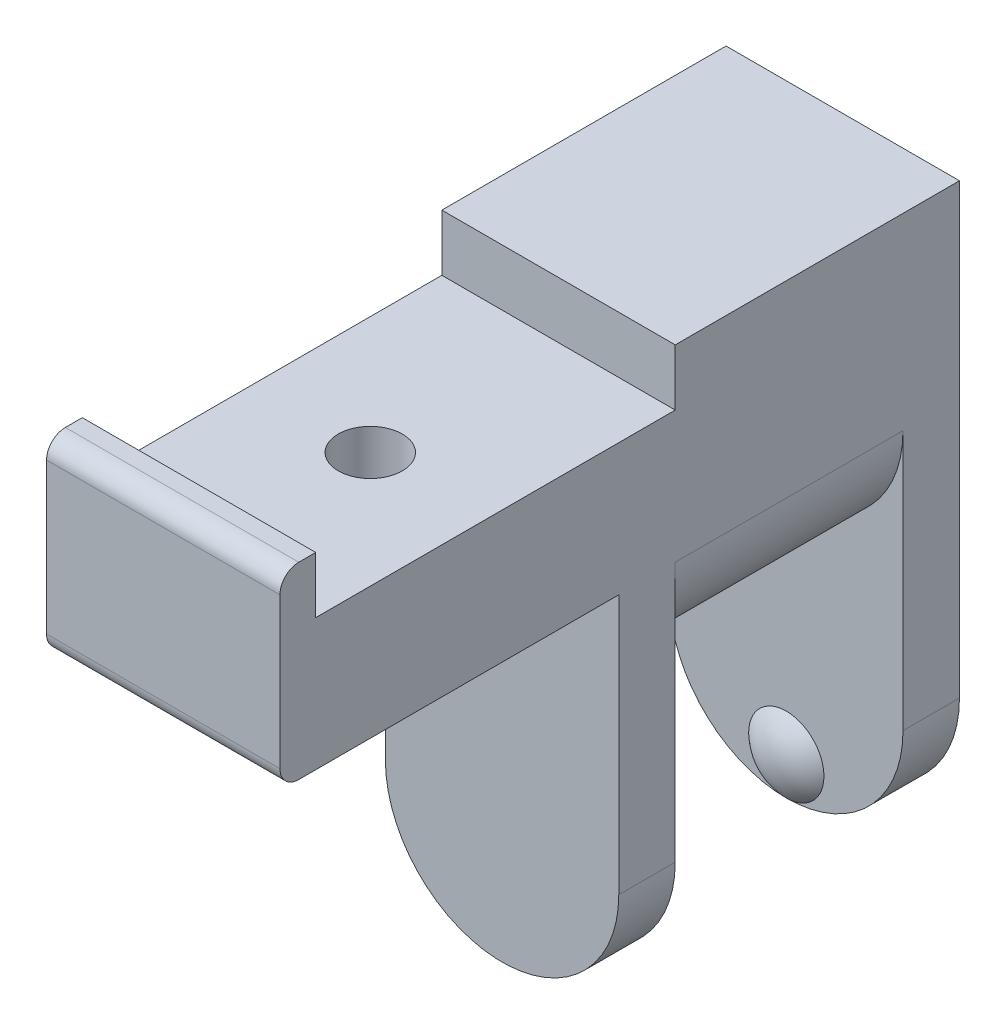
ISO-10303-21;
HEADER;
FILE_DESCRIPTION(('STEP AP214'),'2;1');
FILE_NAME('part.step','',(''),(''),'','','');
FILE_SCHEMA(('AUTOMOTIVE_DESIGN { 1 0 10303 214 1 1 1 1 }'));
ENDSEC;
DATA;
#1=APPLICATION_CONTEXT('core data for automotive mechanical design processes');
#2=APPLICATION_PROTOCOL_DEFINITION('international standard','automotive_design',2000,#1);
#3=PRODUCT_CONTEXT('',#1,'mechanical');
#4=PRODUCT('Part','Part','',(#3));
#5=PRODUCT_RELATED_PRODUCT_CATEGORY('part','',(#4));
#6=PRODUCT_DEFINITION_FORMATION('','',#4);
#7=PRODUCT_DEFINITION_CONTEXT('part definition',#1,'design');
#8=PRODUCT_DEFINITION('design','',#6,#7);
#9=PRODUCT_DEFINITION_SHAPE('','',#8);
#10=(LENGTH_UNIT() NAMED_UNIT(*) SI_UNIT(.MILLI.,.METRE.));
#11=(NAMED_UNIT(*) PLANE_ANGLE_UNIT() SI_UNIT($,.RADIAN.));
#12=(NAMED_UNIT(*) SI_UNIT($,.STERADIAN.) SOLID_ANGLE_UNIT());
#13=UNCERTAINTY_MEASURE_WITH_UNIT(LENGTH_MEASURE(1.E-05),#10,'distance_accuracy_value','');
#14=(GEOMETRIC_REPRESENTATION_CONTEXT(3) GLOBAL_UNCERTAINTY_ASSIGNED_CONTEXT((#13)) GLOBAL_UNIT_ASSIGNED_CONTEXT((#10,
#11,#12)) REPRESENTATION_CONTEXT('',''));
#15=CARTESIAN_POINT('',(0.,0.,0.));
#16=DIRECTION('',(0.,0.,1.));
#17=DIRECTION('',(1.,0.,0.));
#18=AXIS2_PLACEMENT_3D('',#15,#16,#17);
#19=CARTESIAN_POINT('',(12.4,0.,3.));
#20=DIRECTION('',(0.,0.,-1.));
#21=DIRECTION('',(0.,1.,0.));
#22=AXIS2_PLACEMENT_3D('',#19,#20,#21);
#23=PLANE('',#22);
#24=DIRECTION('',(0.,-1.,0.));
#25=VECTOR('',#24,1.);
#26=CARTESIAN_POINT('',(0.,0.,3.));
#27=LINE('',#26,#25);
#28=CARTESIAN_POINT('',(0.,0.,3.));
#29=VERTEX_POINT('',#28);
#30=CARTESIAN_POINT('',(0.,-13.8,3.));
#31=VERTEX_POINT('',#30);
#32=EDGE_CURVE('E284',#29,#31,#27,.T.);
#33=ORIENTED_EDGE('',*,*,#32,.T.);
#34=CARTESIAN_POINT('',(6.2,-13.8,3.));
#35=DIRECTION('',(0.,0.,-1.));
#36=DIRECTION('',(0.,1.,0.));
#37=AXIS2_PLACEMENT_3D('',#34,#35,#36);
#38=CIRCLE('',#37,6.2);
#39=CARTESIAN_POINT('',(12.4,-13.8,3.));
#40=VERTEX_POINT('',#39);
#41=EDGE_CURVE('E312',#31,#40,#38,.F.);
#42=ORIENTED_EDGE('',*,*,#41,.T.);
#43=DIRECTION('',(0.,-1.,0.));
#44=VECTOR('',#43,1.);
#45=CARTESIAN_POINT('',(12.4,0.,3.));
#46=LINE('',#45,#44);
#47=CARTESIAN_POINT('',(12.4,0.,3.));
#48=VERTEX_POINT('',#47);
#49=EDGE_CURVE('E268',#48,#40,#46,.T.);
#50=ORIENTED_EDGE('',*,*,#49,.F.);
#51=DIRECTION('',(-1.,0.,0.));
#52=VECTOR('',#51,1.);
#53=CARTESIAN_POINT('',(12.4,0.,3.));
#54=LINE('',#53,#52);
#55=EDGE_CURVE('E220',#48,#29,#54,.T.);
#56=ORIENTED_EDGE('',*,*,#55,.T.);
#57=EDGE_LOOP('',(#33,#42,#50,#56));
#58=FACE_BOUND('',#57,.T.);
#59=ADVANCED_FACE('F43',(#58),#23,.F.);
#60=CARTESIAN_POINT('',(12.4,0.,0.));
#61=DIRECTION('',(0.,0.,1.));
#62=DIRECTION('',(1.,0.,0.));
#63=AXIS2_PLACEMENT_3D('',#60,#61,#62);
#64=PLANE('',#63);
#65=DIRECTION('',(0.,1.,0.));
#66=VECTOR('',#65,1.);
#67=CARTESIAN_POINT('',(12.4,0.,0.));
#68=LINE('',#67,#66);
#69=CARTESIAN_POINT('',(12.4,-13.8,0.));
#70=VERTEX_POINT('',#69);
#71=CARTESIAN_POINT('',(12.4,0.,0.));
#72=VERTEX_POINT('',#71);
#73=EDGE_CURVE('E334',#70,#72,#68,.T.);
#74=ORIENTED_EDGE('',*,*,#73,.F.);
#75=CARTESIAN_POINT('',(6.2,-13.8,0.));
#76=DIRECTION('',(0.,0.,1.));
#77=DIRECTION('',(1.,0.,0.));
#78=AXIS2_PLACEMENT_3D('',#75,#76,#77);
#79=CIRCLE('',#78,6.2);
#80=CARTESIAN_POINT('',(0.,-13.8,0.));
#81=VERTEX_POINT('',#80);
#82=EDGE_CURVE('E301',#70,#81,#79,.F.);
#83=ORIENTED_EDGE('',*,*,#82,.T.);
#84=DIRECTION('',(0.,1.,0.));
#85=VECTOR('',#84,1.);
#86=CARTESIAN_POINT('',(0.,0.,0.));
#87=LINE('',#86,#85);
#88=CARTESIAN_POINT('',(0.,0.,0.));
#89=VERTEX_POINT('',#88);
#90=EDGE_CURVE('E196',#81,#89,#87,.T.);
#91=ORIENTED_EDGE('',*,*,#90,.T.);
#92=CARTESIAN_POINT('',(6.2,0.,0.));
#93=DIRECTION('',(0.,0.,-1.));
#94=DIRECTION('',(1.,0.,0.));
#95=AXIS2_PLACEMENT_3D('',#92,#93,#94);
#96=CIRCLE('',#95,6.2);
#97=EDGE_CURVE('E300',#72,#89,#96,.T.);
#98=ORIENTED_EDGE('',*,*,#97,.F.);
#99=EDGE_LOOP('',(#74,#83,#91,#98));
#100=FACE_BOUND('',#99,.T.);
#101=ADVANCED_FACE('F299',(#100),#64,.F.);
#102=CARTESIAN_POINT('',(12.4,0.,-12.1));
#103=DIRECTION('',(0.,0.,-1.));
#104=DIRECTION('',(0.,1.,0.));
#105=AXIS2_PLACEMENT_3D('',#102,#103,#104);
#106=PLANE('',#105);
#107=CARTESIAN_POINT('',(6.2,-13.8,-12.1));
#108=DIRECTION('',(0.,0.,-1.));
#109=DIRECTION('',(0.,1.,0.));
#110=AXIS2_PLACEMENT_3D('',#107,#108,#109);
#111=CIRCLE('',#110,6.2);
#112=CARTESIAN_POINT('',(0.,-13.8,-12.1));
#113=VERTEX_POINT('',#112);
#114=CARTESIAN_POINT('',(6.2,-20.,-12.1));
#115=VERTEX_POINT('',#114);
#116=EDGE_CURVE('E166',#113,#115,#111,.F.);
#117=ORIENTED_EDGE('',*,*,#116,.T.);
#118=CARTESIAN_POINT('',(6.2,-18.,-12.1));
#119=DIRECTION('',(0.,0.,1.));
#120=DIRECTION('',(1.,0.,0.));
#121=AXIS2_PLACEMENT_3D('',#118,#119,#120);
#122=CIRCLE('',#121,2.);
#123=EDGE_CURVE('E57',#115,#115,#122,.T.);
#124=ORIENTED_EDGE('',*,*,#123,.F.);
#125=CARTESIAN_POINT('',(12.4,-13.8,-12.1));
#126=VERTEX_POINT('',#125);
#127=EDGE_CURVE('E445',#115,#126,#111,.F.);
#128=ORIENTED_EDGE('',*,*,#127,.T.);
#129=DIRECTION('',(0.,-1.,0.));
#130=VECTOR('',#129,1.);
#131=CARTESIAN_POINT('',(12.4,0.,-12.1));
#132=LINE('',#131,#130);
#133=CARTESIAN_POINT('',(12.4,0.,-12.1));
#134=VERTEX_POINT('',#133);
#135=EDGE_CURVE('E337',#134,#126,#132,.T.);
#136=ORIENTED_EDGE('',*,*,#135,.F.);
#137=CARTESIAN_POINT('',(6.2,0.,-12.1));
#138=DIRECTION('',(0.,0.,-1.));
#139=DIRECTION('',(0.,1.,0.));
#140=AXIS2_PLACEMENT_3D('',#137,#138,#139);
#141=CIRCLE('',#140,6.2);
#142=CARTESIAN_POINT('',(0.,0.,-12.1));
#143=VERTEX_POINT('',#142);
#144=EDGE_CURVE('E316',#134,#143,#141,.T.);
#145=ORIENTED_EDGE('',*,*,#144,.T.);
#146=DIRECTION('',(0.,-1.,0.));
#147=VECTOR('',#146,1.);
#148=CARTESIAN_POINT('',(0.,0.,-12.1));
#149=LINE('',#148,#147);
#150=EDGE_CURVE('E190',#143,#113,#149,.T.);
#151=ORIENTED_EDGE('',*,*,#150,.T.);
#152=EDGE_LOOP('',(#117,#124,#128,#136,#145,#151));
#153=FACE_BOUND('',#152,.T.);
#154=ADVANCED_FACE('F384',(#153),#106,.F.);
#155=CARTESIAN_POINT('',(12.4,0.,-15.1));
#156=DIRECTION('',(0.,0.,1.));
#157=DIRECTION('',(0.,-1.,0.));
#158=AXIS2_PLACEMENT_3D('',#155,#156,#157);
#159=PLANE('',#158);
#160=DIRECTION('',(0.,1.,0.));
#161=VECTOR('',#160,1.);
#162=CARTESIAN_POINT('',(12.4,0.,-15.1));
#163=LINE('',#162,#161);
#164=CARTESIAN_POINT('',(12.4,-13.8,-15.1));
#165=VERTEX_POINT('',#164);
#166=CARTESIAN_POINT('',(12.4,10.,-15.1));
#167=VERTEX_POINT('',#166);
#168=EDGE_CURVE('E179',#165,#167,#163,.T.);
#169=ORIENTED_EDGE('',*,*,#168,.F.);
#170=CARTESIAN_POINT('',(6.2,-13.8,-15.1));
#171=DIRECTION('',(0.,0.,-1.));
#172=DIRECTION('',(1.,0.,0.));
#173=AXIS2_PLACEMENT_3D('',#170,#171,#172);
#174=CIRCLE('',#173,6.2);
#175=CARTESIAN_POINT('',(0.,-13.8,-15.1));
#176=VERTEX_POINT('',#175);
#177=EDGE_CURVE('E162',#165,#176,#174,.T.);
#178=ORIENTED_EDGE('',*,*,#177,.T.);
#179=DIRECTION('',(0.,1.,0.));
#180=VECTOR('',#179,1.);
#181=CARTESIAN_POINT('',(0.,0.,-15.1));
#182=LINE('',#181,#180);
#183=CARTESIAN_POINT('',(0.,10.,-15.1));
#184=VERTEX_POINT('',#183);
#185=EDGE_CURVE('E177',#176,#184,#182,.T.);
#186=ORIENTED_EDGE('',*,*,#185,.T.);
#187=DIRECTION('',(-1.,0.,0.));
#188=VECTOR('',#187,1.);
#189=CARTESIAN_POINT('',(12.4,10.,-15.1));
#190=LINE('',#189,#188);
#191=EDGE_CURVE('E217',#167,#184,#190,.T.);
#192=ORIENTED_EDGE('',*,*,#191,.F.);
#193=EDGE_LOOP('',(#169,#178,#186,#192));
#194=FACE_BOUND('',#193,.T.);
#195=ADVANCED_FACE('F175',(#194),#159,.F.);
#196=CARTESIAN_POINT('',(12.4,0.,19.1));
#197=DIRECTION('',(0.,0.,-1.));
#198=DIRECTION('',(-1.,0.,0.));
#199=AXIS2_PLACEMENT_3D('',#196,#197,#198);
#200=PLANE('',#199);
#201=DIRECTION('',(0.,-1.,0.));
#202=VECTOR('',#201,1.);
#203=CARTESIAN_POINT('',(0.,0.,19.1));
#204=LINE('',#203,#202);
#205=CARTESIAN_POINT('',(0.,9.99999999999999,19.1));
#206=VERTEX_POINT('',#205);
#207=CARTESIAN_POINT('',(0.,6.99999999999999,19.1));
#208=VERTEX_POINT('',#207);
#209=EDGE_CURVE('E286',#206,#208,#204,.T.);
#210=ORIENTED_EDGE('',*,*,#209,.F.);
#211=DIRECTION('',(-1.,0.,0.));
#212=VECTOR('',#211,1.);
#213=CARTESIAN_POINT('',(12.4,9.99999999999999,19.1));
#214=LINE('',#213,#212);
#215=CARTESIAN_POINT('',(12.4,9.99999999999999,19.1));
#216=VERTEX_POINT('',#215);
#217=EDGE_CURVE('E224',#216,#206,#214,.T.);
#218=ORIENTED_EDGE('',*,*,#217,.F.);
#219=DIRECTION('',(0.,-1.,0.));
#220=VECTOR('',#219,1.);
#221=CARTESIAN_POINT('',(12.4,0.,19.1));
#222=LINE('',#221,#220);
#223=CARTESIAN_POINT('',(12.4,6.99999999999999,19.1));
#224=VERTEX_POINT('',#223);
#225=EDGE_CURVE('E206',#216,#224,#222,.T.);
#226=ORIENTED_EDGE('',*,*,#225,.T.);
#227=DIRECTION('',(-1.,0.,0.));
#228=VECTOR('',#227,1.);
#229=CARTESIAN_POINT('',(12.4,6.99999999999999,19.1));
#230=LINE('',#229,#228);
#231=EDGE_CURVE('E207',#224,#208,#230,.T.);
#232=ORIENTED_EDGE('',*,*,#231,.T.);
#233=EDGE_LOOP('',(#210,#218,#226,#232));
#234=FACE_BOUND('',#233,.T.);
#235=ADVANCED_FACE('F366',(#234),#200,.T.);
#236=CARTESIAN_POINT('',(12.4,10.,0.));
#237=DIRECTION('',(0.,-1.,0.));
#238=DIRECTION('',(0.,0.,-1.));
#239=AXIS2_PLACEMENT_3D('',#236,#237,#238);
#240=PLANE('',#239);
#241=DIRECTION('',(0.,0.,1.));
#242=VECTOR('',#241,1.);
#243=CARTESIAN_POINT('',(0.,10.,0.));
#244=LINE('',#243,#242);
#245=CARTESIAN_POINT('',(0.,9.99999999999999,20.));
#246=VERTEX_POINT('',#245);
#247=EDGE_CURVE('E280',#206,#246,#244,.T.);
#248=ORIENTED_EDGE('',*,*,#247,.T.);
#249=DIRECTION('',(-1.,0.,0.));
#250=VECTOR('',#249,1.);
#251=CARTESIAN_POINT('',(12.4,9.99999999999999,20.));
#252=LINE('',#251,#250);
#253=CARTESIAN_POINT('',(12.4,9.99999999999999,20.));
#254=VERTEX_POINT('',#253);
#255=EDGE_CURVE('E11',#246,#254,#252,.F.);
#256=ORIENTED_EDGE('',*,*,#255,.T.);
#257=DIRECTION('',(0.,0.,1.));
#258=VECTOR('',#257,1.);
#259=CARTESIAN_POINT('',(12.4,10.,0.));
#260=LINE('',#259,#258);
#261=EDGE_CURVE('E327',#216,#254,#260,.T.);
#262=ORIENTED_EDGE('',*,*,#261,.F.);
#263=ORIENTED_EDGE('',*,*,#217,.T.);
#264=EDGE_LOOP('',(#248,#256,#262,#263));
#265=FACE_BOUND('',#264,.T.);
#266=ADVANCED_FACE('F367',(#265),#240,.F.);
#267=CARTESIAN_POINT('',(12.4,0.,21.));
#268=DIRECTION('',(0.,0.,-1.));
#269=DIRECTION('',(-1.,0.,0.));
#270=AXIS2_PLACEMENT_3D('',#267,#268,#269);
#271=PLANE('',#270);
#272=DIRECTION('',(0.,-1.,0.));
#273=VECTOR('',#272,1.);
#274=CARTESIAN_POINT('',(0.,0.,21.));
#275=LINE('',#274,#273);
#276=CARTESIAN_POINT('',(0.,8.99999999999999,21.));
#277=VERTEX_POINT('',#276);
#278=CARTESIAN_POINT('',(0.,0.999999999999998,21.));
#279=VERTEX_POINT('',#278);
#280=EDGE_CURVE('E273',#277,#279,#275,.T.);
#281=ORIENTED_EDGE('',*,*,#280,.T.);
#282=DIRECTION('',(-1.,0.,0.));
#283=VECTOR('',#282,1.);
#284=CARTESIAN_POINT('',(12.4,0.999999999999998,21.));
#285=LINE('',#284,#283);
#286=CARTESIAN_POINT('',(12.4,0.999999999999998,21.));
#287=VERTEX_POINT('',#286);
#288=EDGE_CURVE('E245',#279,#287,#285,.F.);
#289=ORIENTED_EDGE('',*,*,#288,.T.);
#290=DIRECTION('',(0.,-1.,0.));
#291=VECTOR('',#290,1.);
#292=CARTESIAN_POINT('',(12.4,0.,21.));
#293=LINE('',#292,#291);
#294=CARTESIAN_POINT('',(12.4,8.99999999999999,21.));
#295=VERTEX_POINT('',#294);
#296=EDGE_CURVE('E260',#295,#287,#293,.T.);
#297=ORIENTED_EDGE('',*,*,#296,.F.);
#298=DIRECTION('',(-1.,0.,0.));
#299=VECTOR('',#298,1.);
#300=CARTESIAN_POINT('',(12.4,8.99999999999999,21.));
#301=LINE('',#300,#299);
#302=EDGE_CURVE('E241',#295,#277,#301,.T.);
#303=ORIENTED_EDGE('',*,*,#302,.T.);
#304=EDGE_LOOP('',(#281,#289,#297,#303));
#305=FACE_BOUND('',#304,.T.);
#306=ADVANCED_FACE('F277',(#305),#271,.F.);
#307=CARTESIAN_POINT('',(12.4,0.,0.));
#308=DIRECTION('',(0.,1.,0.));
#309=DIRECTION('',(0.,0.,1.));
#310=AXIS2_PLACEMENT_3D('',#307,#308,#309);
#311=PLANE('',#310);
#312=CARTESIAN_POINT('',(6.25,0.,10.05));
#313=DIRECTION('',(0.,1.,0.));
#314=DIRECTION('',(0.,0.,1.));
#315=AXIS2_PLACEMENT_3D('',#312,#313,#314);
#316=CIRCLE('',#315,1.7);
#317=CARTESIAN_POINT('',(6.25,0.,11.75));
#318=VERTEX_POINT('',#317);
#319=EDGE_CURVE('E181',#318,#318,#316,.T.);
#320=ORIENTED_EDGE('',*,*,#319,.T.);
#321=EDGE_LOOP('',(#320));
#322=FACE_BOUND('',#321,.T.);
#323=DIRECTION('',(0.,0.,-1.));
#324=VECTOR('',#323,1.);
#325=CARTESIAN_POINT('',(12.4,0.,0.));
#326=LINE('',#325,#324);
#327=CARTESIAN_POINT('',(12.4,0.,20.));
#328=VERTEX_POINT('',#327);
#329=EDGE_CURVE('E257',#328,#48,#326,.T.);
#330=ORIENTED_EDGE('',*,*,#329,.F.);
#331=DIRECTION('',(-1.,0.,0.));
#332=VECTOR('',#331,1.);
#333=CARTESIAN_POINT('',(12.4,0.,20.));
#334=LINE('',#333,#332);
#335=CARTESIAN_POINT('',(0.,0.,20.));
#336=VERTEX_POINT('',#335);
#337=EDGE_CURVE('E231',#328,#336,#334,.T.);
#338=ORIENTED_EDGE('',*,*,#337,.T.);
#339=DIRECTION('',(0.,0.,-1.));
#340=VECTOR('',#339,1.);
#341=CARTESIAN_POINT('',(0.,0.,0.));
#342=LINE('',#341,#340);
#343=EDGE_CURVE('E275',#336,#29,#342,.T.);
#344=ORIENTED_EDGE('',*,*,#343,.T.);
#345=ORIENTED_EDGE('',*,*,#55,.F.);
#346=EDGE_LOOP('',(#330,#338,#344,#345));
#347=FACE_BOUND('',#346,.T.);
#348=ADVANCED_FACE('F265',(#322,#347),#311,.F.);
#349=CARTESIAN_POINT('',(12.4,10.,0.));
#350=DIRECTION('',(0.,-1.,0.));
#351=DIRECTION('',(0.,0.,-1.));
#352=AXIS2_PLACEMENT_3D('',#349,#350,#351);
#353=PLANE('',#352);
#354=DIRECTION('',(0.,0.,1.));
#355=VECTOR('',#354,1.);
#356=CARTESIAN_POINT('',(0.,10.,0.));
#357=LINE('',#356,#355);
#358=CARTESIAN_POINT('',(0.,10.,0.));
#359=VERTEX_POINT('',#358);
#360=EDGE_CURVE('E188',#184,#359,#357,.T.);
#361=ORIENTED_EDGE('',*,*,#360,.T.);
#362=DIRECTION('',(-1.,0.,0.));
#363=VECTOR('',#362,1.);
#364=CARTESIAN_POINT('',(12.4,10.,0.));
#365=LINE('',#364,#363);
#366=CARTESIAN_POINT('',(12.4,10.,0.));
#367=VERTEX_POINT('',#366);
#368=EDGE_CURVE('E214',#367,#359,#365,.T.);
#369=ORIENTED_EDGE('',*,*,#368,.F.);
#370=DIRECTION('',(0.,0.,1.));
#371=VECTOR('',#370,1.);
#372=CARTESIAN_POINT('',(12.4,10.,0.));
#373=LINE('',#372,#371);
#374=EDGE_CURVE('E343',#167,#367,#373,.T.);
#375=ORIENTED_EDGE('',*,*,#374,.F.);
#376=ORIENTED_EDGE('',*,*,#191,.T.);
#377=EDGE_LOOP('',(#361,#369,#375,#376));
#378=FACE_BOUND('',#377,.T.);
#379=ADVANCED_FACE('F390',(#378),#353,.F.);
#380=CARTESIAN_POINT('',(12.4,0.,0.));
#381=DIRECTION('',(0.,0.,1.));
#382=DIRECTION('',(1.,0.,0.));
#383=AXIS2_PLACEMENT_3D('',#380,#381,#382);
#384=PLANE('',#383);
#385=DIRECTION('',(0.,1.,0.));
#386=VECTOR('',#385,1.);
#387=CARTESIAN_POINT('',(0.,0.,0.));
#388=LINE('',#387,#386);
#389=CARTESIAN_POINT('',(0.,6.99999999999999,0.));
#390=VERTEX_POINT('',#389);
#391=EDGE_CURVE('E194',#390,#359,#388,.T.);
#392=ORIENTED_EDGE('',*,*,#391,.F.);
#393=DIRECTION('',(-1.,0.,0.));
#394=VECTOR('',#393,1.);
#395=CARTESIAN_POINT('',(12.4,6.99999999999999,0.));
#396=LINE('',#395,#394);
#397=CARTESIAN_POINT('',(12.4,6.99999999999999,0.));
#398=VERTEX_POINT('',#397);
#399=EDGE_CURVE('E210',#398,#390,#396,.T.);
#400=ORIENTED_EDGE('',*,*,#399,.F.);
#401=DIRECTION('',(0.,1.,0.));
#402=VECTOR('',#401,1.);
#403=CARTESIAN_POINT('',(12.4,0.,0.));
#404=LINE('',#403,#402);
#405=EDGE_CURVE('E346',#398,#367,#404,.T.);
#406=ORIENTED_EDGE('',*,*,#405,.T.);
#407=ORIENTED_EDGE('',*,*,#368,.T.);
#408=EDGE_LOOP('',(#392,#400,#406,#407));
#409=FACE_BOUND('',#408,.T.);
#410=ADVANCED_FACE('F362',(#409),#384,.T.);
#411=CARTESIAN_POINT('',(12.4,6.99999999999999,0.));
#412=DIRECTION('',(0.,1.,0.));
#413=DIRECTION('',(0.,0.,1.));
#414=AXIS2_PLACEMENT_3D('',#411,#412,#413);
#415=PLANE('',#414);
#416=CARTESIAN_POINT('',(6.25,6.99999999999999,10.05));
#417=DIRECTION('',(0.,1.,0.));
#418=DIRECTION('',(0.,0.,1.));
#419=AXIS2_PLACEMENT_3D('',#416,#417,#418);
#420=CIRCLE('',#419,1.7);
#421=CARTESIAN_POINT('',(6.25,6.99999999999999,11.75));
#422=VERTEX_POINT('',#421);
#423=EDGE_CURVE('E434',#422,#422,#420,.T.);
#424=ORIENTED_EDGE('',*,*,#423,.F.);
#425=EDGE_LOOP('',(#424));
#426=FACE_BOUND('',#425,.T.);
#427=DIRECTION('',(0.,0.,-1.));
#428=VECTOR('',#427,1.);
#429=CARTESIAN_POINT('',(0.,6.99999999999999,0.));
#430=LINE('',#429,#428);
#431=EDGE_CURVE('E202',#208,#390,#430,.T.);
#432=ORIENTED_EDGE('',*,*,#431,.F.);
#433=ORIENTED_EDGE('',*,*,#231,.F.);
#434=DIRECTION('',(0.,0.,-1.));
#435=VECTOR('',#434,1.);
#436=CARTESIAN_POINT('',(12.4,6.99999999999999,0.));
#437=LINE('',#436,#435);
#438=EDGE_CURVE('E211',#224,#398,#437,.T.);
#439=ORIENTED_EDGE('',*,*,#438,.T.);
#440=ORIENTED_EDGE('',*,*,#399,.T.);
#441=EDGE_LOOP('',(#432,#433,#439,#440));
#442=FACE_BOUND('',#441,.T.);
#443=ADVANCED_FACE('F355',(#426,#442),#415,.T.);
#444=CARTESIAN_POINT('',(12.4,0.,0.));
#445=DIRECTION('',(1.,0.,0.));
#446=DIRECTION('',(0.,0.,-1.));
#447=AXIS2_PLACEMENT_3D('',#444,#445,#446);
#448=PLANE('',#447);
#449=ORIENTED_EDGE('',*,*,#296,.T.);
#450=CARTESIAN_POINT('',(12.4,0.999999999999998,20.));
#451=DIRECTION('',(1.,0.,0.));
#452=DIRECTION('',(0.,0.,-1.));
#453=AXIS2_PLACEMENT_3D('',#450,#451,#452);
#454=CIRCLE('',#453,1.);
#455=EDGE_CURVE('E52',#287,#328,#454,.T.);
#456=ORIENTED_EDGE('',*,*,#455,.T.);
#457=ORIENTED_EDGE('',*,*,#329,.T.);
#458=ORIENTED_EDGE('',*,*,#49,.T.);
#459=DIRECTION('',(0.,0.,1.));
#460=VECTOR('',#459,1.);
#461=CARTESIAN_POINT('',(12.4,-13.8,-15.1));
#462=LINE('',#461,#460);
#463=EDGE_CURVE('E171',#70,#40,#462,.T.);
#464=ORIENTED_EDGE('',*,*,#463,.F.);
#465=ORIENTED_EDGE('',*,*,#73,.T.);
#466=DIRECTION('',(0.,0.,1.));
#467=VECTOR('',#466,1.);
#468=CARTESIAN_POINT('',(12.4,0.,-35.5130263801639));
#469=LINE('',#468,#467);
#470=EDGE_CURVE('E310',#134,#72,#469,.T.);
#471=ORIENTED_EDGE('',*,*,#470,.F.);
#472=ORIENTED_EDGE('',*,*,#135,.T.);
#473=EDGE_CURVE('E443',#165,#126,#462,.T.);
#474=ORIENTED_EDGE('',*,*,#473,.F.);
#475=ORIENTED_EDGE('',*,*,#168,.T.);
#476=ORIENTED_EDGE('',*,*,#374,.T.);
#477=ORIENTED_EDGE('',*,*,#405,.F.);
#478=ORIENTED_EDGE('',*,*,#438,.F.);
#479=ORIENTED_EDGE('',*,*,#225,.F.);
#480=ORIENTED_EDGE('',*,*,#261,.T.);
#481=CARTESIAN_POINT('',(12.4,8.99999999999999,20.));
#482=DIRECTION('',(1.,0.,0.));
#483=DIRECTION('',(0.,0.,-1.));
#484=AXIS2_PLACEMENT_3D('',#481,#482,#483);
#485=CIRCLE('',#484,1.);
#486=EDGE_CURVE('E248',#254,#295,#485,.T.);
#487=ORIENTED_EDGE('',*,*,#486,.T.);
#488=EDGE_LOOP('',(#449,#456,#457,#458,#464,#465,#471,#472,#474,#475,#476,#477,#478,#479,#480,#487));
#489=FACE_BOUND('',#488,.T.);
#490=ADVANCED_FACE('F255',(#489),#448,.T.);
#491=CARTESIAN_POINT('',(0.,0.,0.));
#492=DIRECTION('',(1.,0.,0.));
#493=DIRECTION('',(0.,0.,-1.));
#494=AXIS2_PLACEMENT_3D('',#491,#492,#493);
#495=PLANE('',#494);
#496=ORIENTED_EDGE('',*,*,#343,.F.);
#497=CARTESIAN_POINT('',(0.,0.999999999999998,20.));
#498=DIRECTION('',(1.,0.,0.));
#499=DIRECTION('',(0.,0.,-1.));
#500=AXIS2_PLACEMENT_3D('',#497,#498,#499);
#501=CIRCLE('',#500,1.);
#502=EDGE_CURVE('E238',#336,#279,#501,.F.);
#503=ORIENTED_EDGE('',*,*,#502,.T.);
#504=ORIENTED_EDGE('',*,*,#280,.F.);
#505=CARTESIAN_POINT('',(0.,8.99999999999999,20.));
#506=DIRECTION('',(1.,0.,0.));
#507=DIRECTION('',(0.,0.,-1.));
#508=AXIS2_PLACEMENT_3D('',#505,#506,#507);
#509=CIRCLE('',#508,1.);
#510=EDGE_CURVE('E235',#277,#246,#509,.F.);
#511=ORIENTED_EDGE('',*,*,#510,.T.);
#512=ORIENTED_EDGE('',*,*,#247,.F.);
#513=ORIENTED_EDGE('',*,*,#209,.T.);
#514=ORIENTED_EDGE('',*,*,#431,.T.);
#515=ORIENTED_EDGE('',*,*,#391,.T.);
#516=ORIENTED_EDGE('',*,*,#360,.F.);
#517=ORIENTED_EDGE('',*,*,#185,.F.);
#518=DIRECTION('',(0.,0.,1.));
#519=VECTOR('',#518,1.);
#520=CARTESIAN_POINT('',(0.,-13.8,-15.1));
#521=LINE('',#520,#519);
#522=EDGE_CURVE('E158',#176,#113,#521,.T.);
#523=ORIENTED_EDGE('',*,*,#522,.T.);
#524=ORIENTED_EDGE('',*,*,#150,.F.);
#525=DIRECTION('',(0.,0.,1.));
#526=VECTOR('',#525,1.);
#527=CARTESIAN_POINT('',(0.,0.,-35.5130263801639));
#528=LINE('',#527,#526);
#529=EDGE_CURVE('E308',#143,#89,#528,.T.);
#530=ORIENTED_EDGE('',*,*,#529,.T.);
#531=ORIENTED_EDGE('',*,*,#90,.F.);
#532=DIRECTION('',(0.,0.,1.));
#533=VECTOR('',#532,1.);
#534=CARTESIAN_POINT('',(0.,-13.8,0.));
#535=LINE('',#534,#533);
#536=EDGE_CURVE('E227',#81,#31,#535,.T.);
#537=ORIENTED_EDGE('',*,*,#536,.T.);
#538=ORIENTED_EDGE('',*,*,#32,.F.);
#539=EDGE_LOOP('',(#496,#503,#504,#511,#512,#513,#514,#515,#516,#517,#523,#524,#530,#531,#537,#538));
#540=FACE_BOUND('',#539,.T.);
#541=ADVANCED_FACE('F185',(#540),#495,.F.);
#542=CARTESIAN_POINT('',(6.2,0.,-35.5130263801639));
#543=DIRECTION('',(0.,0.,1.));
#544=DIRECTION('',(1.,0.,0.));
#545=AXIS2_PLACEMENT_3D('',#542,#543,#544);
#546=CYLINDRICAL_SURFACE('',#545,6.2);
#547=ORIENTED_EDGE('',*,*,#470,.T.);
#548=ORIENTED_EDGE('',*,*,#97,.T.);
#549=ORIENTED_EDGE('',*,*,#529,.F.);
#550=ORIENTED_EDGE('',*,*,#144,.F.);
#551=EDGE_LOOP('',(#547,#548,#549,#550));
#552=FACE_BOUND('',#551,.T.);
#553=ADVANCED_FACE('F306',(#552),#546,.T.);
#554=CARTESIAN_POINT('',(6.2,-13.8,-15.1));
#555=DIRECTION('',(0.,0.,1.));
#556=DIRECTION('',(1.,0.,0.));
#557=AXIS2_PLACEMENT_3D('',#554,#555,#556);
#558=CYLINDRICAL_SURFACE('',#557,6.2);
#559=ORIENTED_EDGE('',*,*,#536,.F.);
#560=ORIENTED_EDGE('',*,*,#82,.F.);
#561=ORIENTED_EDGE('',*,*,#463,.T.);
#562=ORIENTED_EDGE('',*,*,#41,.F.);
#563=EDGE_LOOP('',(#559,#560,#561,#562));
#564=FACE_BOUND('',#563,.T.);
#565=ADVANCED_FACE('F421',(#564),#558,.T.);
#566=ORIENTED_EDGE('',*,*,#522,.F.);
#567=ORIENTED_EDGE('',*,*,#177,.F.);
#568=ORIENTED_EDGE('',*,*,#473,.T.);
#569=ORIENTED_EDGE('',*,*,#127,.F.);
#570=ORIENTED_EDGE('',*,*,#116,.F.);
#571=EDGE_LOOP('',(#566,#567,#568,#569,#570));
#572=FACE_BOUND('',#571,.T.);
#573=ADVANCED_FACE('F160',(#572),#558,.T.);
#574=CARTESIAN_POINT('',(6.25,6.99999999999999,10.05));
#575=DIRECTION('',(0.,1.,0.));
#576=DIRECTION('',(0.,0.,1.));
#577=AXIS2_PLACEMENT_3D('',#574,#575,#576);
#578=CYLINDRICAL_SURFACE('',#577,1.7);
#579=ORIENTED_EDGE('',*,*,#423,.T.);
#580=EDGE_LOOP('',(#579));
#581=FACE_BOUND('',#580,.T.);
#582=ORIENTED_EDGE('',*,*,#319,.F.);
#583=EDGE_LOOP('',(#582));
#584=FACE_BOUND('',#583,.T.);
#585=ADVANCED_FACE('F377',(#581,#584),#578,.F.);
#586=CARTESIAN_POINT('',(12.4,0.999999999999998,20.));
#587=DIRECTION('',(-1.,0.,0.));
#588=DIRECTION('',(0.,0.,1.));
#589=AXIS2_PLACEMENT_3D('',#586,#587,#588);
#590=CYLINDRICAL_SURFACE('',#589,1.);
#591=ORIENTED_EDGE('',*,*,#455,.F.);
#592=ORIENTED_EDGE('',*,*,#288,.F.);
#593=ORIENTED_EDGE('',*,*,#502,.F.);
#594=ORIENTED_EDGE('',*,*,#337,.F.);
#595=EDGE_LOOP('',(#591,#592,#593,#594));
#596=FACE_BOUND('',#595,.T.);
#597=ADVANCED_FACE('F270',(#596),#590,.T.);
#598=CARTESIAN_POINT('',(12.4,8.99999999999999,20.));
#599=DIRECTION('',(-1.,0.,0.));
#600=DIRECTION('',(0.,0.,1.));
#601=AXIS2_PLACEMENT_3D('',#598,#599,#600);
#602=CYLINDRICAL_SURFACE('',#601,1.);
#603=ORIENTED_EDGE('',*,*,#486,.F.);
#604=ORIENTED_EDGE('',*,*,#255,.F.);
#605=ORIENTED_EDGE('',*,*,#510,.F.);
#606=ORIENTED_EDGE('',*,*,#302,.F.);
#607=EDGE_LOOP('',(#603,#604,#605,#606));
#608=FACE_BOUND('',#607,.T.);
#609=ADVANCED_FACE('F45',(#608),#602,.T.);
#610=CARTESIAN_POINT('',(6.2,-18.,-14.2));
#611=DIRECTION('',(0.,0.,1.));
#612=DIRECTION('',(0.,1.,0.));
#613=AXIS2_PLACEMENT_3D('',#610,#611,#612);
#614=SPHERICAL_SURFACE('',#613,2.89999999999999);
#615=ORIENTED_EDGE('',*,*,#123,.T.);
#616=EDGE_LOOP('',(#615));
#617=FACE_BOUND('',#616,.T.);
#618=ADVANCED_FACE('F371',(#617),#614,.T.);
#619=CLOSED_SHELL('',(#59,#101,#154,#195,#235,#266,#306,#348,#379,#410,#443,#490,#541,#553,#565,
#573,#585,#597,#609,#618));
#620=MANIFOLD_SOLID_BREP('B2',#619);
#621=ADVANCED_BREP_SHAPE_REPRESENTATION('',(#18,#620),#14);
#622=SHAPE_DEFINITION_REPRESENTATION(#9,#621);
ENDSEC;
END-ISO-10303-21;
